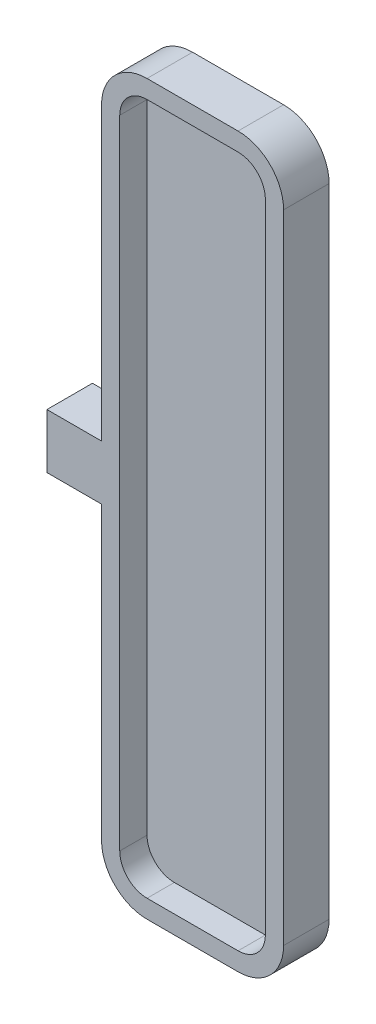
ISO-10303-21;
HEADER;
FILE_DESCRIPTION(('STEP AP214'),'2;1');
FILE_NAME('part.step','',(''),(''),'','','');
FILE_SCHEMA(('AUTOMOTIVE_DESIGN { 1 0 10303 214 1 1 1 1 }'));
ENDSEC;
DATA;
#1=APPLICATION_CONTEXT('core data for automotive mechanical design processes');
#2=APPLICATION_PROTOCOL_DEFINITION('international standard','automotive_design',2000,#1);
#3=PRODUCT_CONTEXT('',#1,'mechanical');
#4=PRODUCT('Part','Part','',(#3));
#5=PRODUCT_RELATED_PRODUCT_CATEGORY('part','',(#4));
#6=PRODUCT_DEFINITION_FORMATION('','',#4);
#7=PRODUCT_DEFINITION_CONTEXT('part definition',#1,'design');
#8=PRODUCT_DEFINITION('design','',#6,#7);
#9=PRODUCT_DEFINITION_SHAPE('','',#8);
#10=(LENGTH_UNIT() NAMED_UNIT(*) SI_UNIT(.MILLI.,.METRE.));
#11=(NAMED_UNIT(*) PLANE_ANGLE_UNIT() SI_UNIT($,.RADIAN.));
#12=(NAMED_UNIT(*) SI_UNIT($,.STERADIAN.) SOLID_ANGLE_UNIT());
#13=UNCERTAINTY_MEASURE_WITH_UNIT(LENGTH_MEASURE(1.E-05),#10,'distance_accuracy_value','');
#14=(GEOMETRIC_REPRESENTATION_CONTEXT(3) GLOBAL_UNCERTAINTY_ASSIGNED_CONTEXT((#13)) GLOBAL_UNIT_ASSIGNED_CONTEXT((#10,
#11,#12)) REPRESENTATION_CONTEXT('',''));
#15=CARTESIAN_POINT('',(0.,0.,0.));
#16=DIRECTION('',(0.,0.,1.));
#17=DIRECTION('',(1.,0.,0.));
#18=AXIS2_PLACEMENT_3D('',#15,#16,#17);
#19=CARTESIAN_POINT('',(-10.,-40.,5.));
#20=DIRECTION('',(1.,0.,0.));
#21=DIRECTION('',(0.,0.,-1.));
#22=AXIS2_PLACEMENT_3D('',#19,#20,#21);
#23=PLANE('',#22);
#24=DIRECTION('',(0.,0.,-1.));
#25=VECTOR('',#24,1.);
#26=CARTESIAN_POINT('',(-10.,3.,5.));
#27=LINE('',#26,#25);
#28=CARTESIAN_POINT('',(-10.,3.,5.));
#29=VERTEX_POINT('',#28);
#30=CARTESIAN_POINT('',(-10.,3.,0.));
#31=VERTEX_POINT('',#30);
#32=EDGE_CURVE('E63',#29,#31,#27,.T.);
#33=ORIENTED_EDGE('',*,*,#32,.F.);
#34=DIRECTION('',(0.,-1.,0.));
#35=VECTOR('',#34,1.);
#36=CARTESIAN_POINT('',(-10.,-40.,5.));
#37=LINE('',#36,#35);
#38=CARTESIAN_POINT('',(-10.,35.,5.));
#39=VERTEX_POINT('',#38);
#40=EDGE_CURVE('E184',#39,#29,#37,.T.);
#41=ORIENTED_EDGE('',*,*,#40,.F.);
#42=DIRECTION('',(0.,0.,-1.));
#43=VECTOR('',#42,1.);
#44=CARTESIAN_POINT('',(-10.,35.,5.));
#45=LINE('',#44,#43);
#46=CARTESIAN_POINT('',(-10.,35.,0.));
#47=VERTEX_POINT('',#46);
#48=EDGE_CURVE('E377',#39,#47,#45,.T.);
#49=ORIENTED_EDGE('',*,*,#48,.T.);
#50=DIRECTION('',(0.,-1.,0.));
#51=VECTOR('',#50,1.);
#52=CARTESIAN_POINT('',(-10.,-40.,0.));
#53=LINE('',#52,#51);
#54=EDGE_CURVE('E333',#47,#31,#53,.T.);
#55=ORIENTED_EDGE('',*,*,#54,.T.);
#56=EDGE_LOOP('',(#33,#41,#49,#55));
#57=FACE_BOUND('',#56,.T.);
#58=ADVANCED_FACE('F39',(#57),#23,.F.);
#59=DIRECTION('',(0.,0.,-1.));
#60=VECTOR('',#59,1.);
#61=CARTESIAN_POINT('',(-10.,-3.,5.));
#62=LINE('',#61,#60);
#63=CARTESIAN_POINT('',(-10.,-3.,5.));
#64=VERTEX_POINT('',#63);
#65=CARTESIAN_POINT('',(-10.,-3.,0.));
#66=VERTEX_POINT('',#65);
#67=EDGE_CURVE('E206',#64,#66,#62,.T.);
#68=ORIENTED_EDGE('',*,*,#67,.T.);
#69=CARTESIAN_POINT('',(-10.,-35.,0.));
#70=VERTEX_POINT('',#69);
#71=EDGE_CURVE('E332',#66,#70,#53,.T.);
#72=ORIENTED_EDGE('',*,*,#71,.T.);
#73=DIRECTION('',(0.,0.,-1.));
#74=VECTOR('',#73,1.);
#75=CARTESIAN_POINT('',(-10.,-35.,5.));
#76=LINE('',#75,#74);
#77=CARTESIAN_POINT('',(-10.,-35.,5.));
#78=VERTEX_POINT('',#77);
#79=EDGE_CURVE('E381',#70,#78,#76,.F.);
#80=ORIENTED_EDGE('',*,*,#79,.T.);
#81=EDGE_CURVE('E55',#64,#78,#37,.T.);
#82=ORIENTED_EDGE('',*,*,#81,.F.);
#83=EDGE_LOOP('',(#68,#72,#80,#82));
#84=FACE_BOUND('',#83,.T.);
#85=ADVANCED_FACE('F409',(#84),#23,.F.);
#86=CARTESIAN_POINT('',(10.,-40.,5.));
#87=DIRECTION('',(-1.,0.,0.));
#88=DIRECTION('',(0.,0.,1.));
#89=AXIS2_PLACEMENT_3D('',#86,#87,#88);
#90=PLANE('',#89);
#91=DIRECTION('',(0.,1.,0.));
#92=VECTOR('',#91,1.);
#93=CARTESIAN_POINT('',(10.,-40.,5.));
#94=LINE('',#93,#92);
#95=CARTESIAN_POINT('',(10.,-35.,5.));
#96=VERTEX_POINT('',#95);
#97=CARTESIAN_POINT('',(10.,35.,5.));
#98=VERTEX_POINT('',#97);
#99=EDGE_CURVE('E310',#96,#98,#94,.T.);
#100=ORIENTED_EDGE('',*,*,#99,.F.);
#101=DIRECTION('',(0.,0.,-1.));
#102=VECTOR('',#101,1.);
#103=CARTESIAN_POINT('',(10.,-35.,5.));
#104=LINE('',#103,#102);
#105=CARTESIAN_POINT('',(10.,-35.,0.));
#106=VERTEX_POINT('',#105);
#107=EDGE_CURVE('E341',#96,#106,#104,.T.);
#108=ORIENTED_EDGE('',*,*,#107,.T.);
#109=DIRECTION('',(0.,1.,0.));
#110=VECTOR('',#109,1.);
#111=CARTESIAN_POINT('',(10.,-40.,0.));
#112=LINE('',#111,#110);
#113=CARTESIAN_POINT('',(10.,35.,0.));
#114=VERTEX_POINT('',#113);
#115=EDGE_CURVE('E266',#106,#114,#112,.T.);
#116=ORIENTED_EDGE('',*,*,#115,.T.);
#117=DIRECTION('',(0.,0.,-1.));
#118=VECTOR('',#117,1.);
#119=CARTESIAN_POINT('',(10.,35.,5.));
#120=LINE('',#119,#118);
#121=EDGE_CURVE('E324',#114,#98,#120,.F.);
#122=ORIENTED_EDGE('',*,*,#121,.T.);
#123=EDGE_LOOP('',(#100,#108,#116,#122));
#124=FACE_BOUND('',#123,.T.);
#125=ADVANCED_FACE('F423',(#124),#90,.F.);
#126=CARTESIAN_POINT('',(-10.,40.,5.));
#127=DIRECTION('',(0.,-1.,0.));
#128=DIRECTION('',(0.,0.,-1.));
#129=AXIS2_PLACEMENT_3D('',#126,#127,#128);
#130=PLANE('',#129);
#131=DIRECTION('',(-1.,0.,0.));
#132=VECTOR('',#131,1.);
#133=CARTESIAN_POINT('',(-10.,40.,0.));
#134=LINE('',#133,#132);
#135=CARTESIAN_POINT('',(5.,40.,0.));
#136=VERTEX_POINT('',#135);
#137=CARTESIAN_POINT('',(-5.,40.,0.));
#138=VERTEX_POINT('',#137);
#139=EDGE_CURVE('E328',#136,#138,#134,.T.);
#140=ORIENTED_EDGE('',*,*,#139,.T.);
#141=DIRECTION('',(0.,0.,-1.));
#142=VECTOR('',#141,1.);
#143=CARTESIAN_POINT('',(-5.,40.,5.));
#144=LINE('',#143,#142);
#145=CARTESIAN_POINT('',(-5.,40.,5.));
#146=VERTEX_POINT('',#145);
#147=EDGE_CURVE('E11',#138,#146,#144,.F.);
#148=ORIENTED_EDGE('',*,*,#147,.T.);
#149=DIRECTION('',(-1.,0.,0.));
#150=VECTOR('',#149,1.);
#151=CARTESIAN_POINT('',(-10.,40.,5.));
#152=LINE('',#151,#150);
#153=CARTESIAN_POINT('',(5.,40.,5.));
#154=VERTEX_POINT('',#153);
#155=EDGE_CURVE('E314',#154,#146,#152,.T.);
#156=ORIENTED_EDGE('',*,*,#155,.F.);
#157=DIRECTION('',(0.,0.,-1.));
#158=VECTOR('',#157,1.);
#159=CARTESIAN_POINT('',(5.,40.,5.));
#160=LINE('',#159,#158);
#161=EDGE_CURVE('E48',#154,#136,#160,.T.);
#162=ORIENTED_EDGE('',*,*,#161,.T.);
#163=EDGE_LOOP('',(#140,#148,#156,#162));
#164=FACE_BOUND('',#163,.T.);
#165=ADVANCED_FACE('F389',(#164),#130,.F.);
#166=CARTESIAN_POINT('',(-10.,-40.,5.));
#167=DIRECTION('',(0.,1.,0.));
#168=DIRECTION('',(0.,0.,1.));
#169=AXIS2_PLACEMENT_3D('',#166,#167,#168);
#170=PLANE('',#169);
#171=DIRECTION('',(1.,0.,0.));
#172=VECTOR('',#171,1.);
#173=CARTESIAN_POINT('',(-10.,-40.,0.));
#174=LINE('',#173,#172);
#175=CARTESIAN_POINT('',(-5.,-40.,0.));
#176=VERTEX_POINT('',#175);
#177=CARTESIAN_POINT('',(5.,-40.,0.));
#178=VERTEX_POINT('',#177);
#179=EDGE_CURVE('E315',#176,#178,#174,.T.);
#180=ORIENTED_EDGE('',*,*,#179,.T.);
#181=DIRECTION('',(0.,0.,-1.));
#182=VECTOR('',#181,1.);
#183=CARTESIAN_POINT('',(5.,-40.,5.));
#184=LINE('',#183,#182);
#185=CARTESIAN_POINT('',(5.,-40.,5.));
#186=VERTEX_POINT('',#185);
#187=EDGE_CURVE('E362',#178,#186,#184,.F.);
#188=ORIENTED_EDGE('',*,*,#187,.T.);
#189=DIRECTION('',(1.,0.,0.));
#190=VECTOR('',#189,1.);
#191=CARTESIAN_POINT('',(-10.,-40.,5.));
#192=LINE('',#191,#190);
#193=CARTESIAN_POINT('',(-5.,-40.,5.));
#194=VERTEX_POINT('',#193);
#195=EDGE_CURVE('E321',#194,#186,#192,.T.);
#196=ORIENTED_EDGE('',*,*,#195,.F.);
#197=DIRECTION('',(0.,0.,-1.));
#198=VECTOR('',#197,1.);
#199=CARTESIAN_POINT('',(-5.,-40.,5.));
#200=LINE('',#199,#198);
#201=EDGE_CURVE('E358',#194,#176,#200,.T.);
#202=ORIENTED_EDGE('',*,*,#201,.T.);
#203=EDGE_LOOP('',(#180,#188,#196,#202));
#204=FACE_BOUND('',#203,.T.);
#205=ADVANCED_FACE('F415',(#204),#170,.F.);
#206=CARTESIAN_POINT('',(0.,0.,5.));
#207=DIRECTION('',(0.,0.,-1.));
#208=DIRECTION('',(-1.,0.,0.));
#209=AXIS2_PLACEMENT_3D('',#206,#207,#208);
#210=PLANE('',#209);
#211=DIRECTION('',(1.,0.,0.));
#212=VECTOR('',#211,1.);
#213=CARTESIAN_POINT('',(0.,-38.,5.));
#214=LINE('',#213,#212);
#215=CARTESIAN_POINT('',(-5.,-38.,5.));
#216=VERTEX_POINT('',#215);
#217=CARTESIAN_POINT('',(5.,-38.,5.));
#218=VERTEX_POINT('',#217);
#219=EDGE_CURVE('E238',#216,#218,#214,.T.);
#220=ORIENTED_EDGE('',*,*,#219,.F.);
#221=CARTESIAN_POINT('',(-5.,-35.,5.));
#222=DIRECTION('',(0.,0.,-1.));
#223=DIRECTION('',(-1.,0.,0.));
#224=AXIS2_PLACEMENT_3D('',#221,#222,#223);
#225=CIRCLE('',#224,3.);
#226=CARTESIAN_POINT('',(-8.,-35.,5.));
#227=VERTEX_POINT('',#226);
#228=EDGE_CURVE('E300',#227,#216,#225,.F.);
#229=ORIENTED_EDGE('',*,*,#228,.F.);
#230=DIRECTION('',(0.,-1.,0.));
#231=VECTOR('',#230,1.);
#232=CARTESIAN_POINT('',(-8.,0.,5.));
#233=LINE('',#232,#231);
#234=CARTESIAN_POINT('',(-8.,35.,5.));
#235=VERTEX_POINT('',#234);
#236=EDGE_CURVE('E297',#235,#227,#233,.T.);
#237=ORIENTED_EDGE('',*,*,#236,.F.);
#238=CARTESIAN_POINT('',(-5.,35.,5.));
#239=DIRECTION('',(0.,0.,-1.));
#240=DIRECTION('',(-1.,0.,0.));
#241=AXIS2_PLACEMENT_3D('',#238,#239,#240);
#242=CIRCLE('',#241,3.);
#243=CARTESIAN_POINT('',(-5.,38.,5.));
#244=VERTEX_POINT('',#243);
#245=EDGE_CURVE('E293',#244,#235,#242,.F.);
#246=ORIENTED_EDGE('',*,*,#245,.F.);
#247=DIRECTION('',(-1.,0.,0.));
#248=VECTOR('',#247,1.);
#249=CARTESIAN_POINT('',(0.,38.,5.));
#250=LINE('',#249,#248);
#251=CARTESIAN_POINT('',(5.,38.,5.));
#252=VERTEX_POINT('',#251);
#253=EDGE_CURVE('E290',#252,#244,#250,.T.);
#254=ORIENTED_EDGE('',*,*,#253,.F.);
#255=CARTESIAN_POINT('',(5.,35.,5.));
#256=DIRECTION('',(0.,0.,-1.));
#257=DIRECTION('',(-1.,0.,0.));
#258=AXIS2_PLACEMENT_3D('',#255,#256,#257);
#259=CIRCLE('',#258,3.);
#260=CARTESIAN_POINT('',(8.,35.,5.));
#261=VERTEX_POINT('',#260);
#262=EDGE_CURVE('E286',#261,#252,#259,.F.);
#263=ORIENTED_EDGE('',*,*,#262,.F.);
#264=DIRECTION('',(0.,1.,0.));
#265=VECTOR('',#264,1.);
#266=CARTESIAN_POINT('',(8.,0.,5.));
#267=LINE('',#266,#265);
#268=CARTESIAN_POINT('',(8.,-35.,5.));
#269=VERTEX_POINT('',#268);
#270=EDGE_CURVE('E248',#269,#261,#267,.T.);
#271=ORIENTED_EDGE('',*,*,#270,.F.);
#272=CARTESIAN_POINT('',(5.,-35.,5.));
#273=DIRECTION('',(0.,0.,-1.));
#274=DIRECTION('',(-1.,0.,0.));
#275=AXIS2_PLACEMENT_3D('',#272,#273,#274);
#276=CIRCLE('',#275,3.);
#277=EDGE_CURVE('E276',#218,#269,#276,.F.);
#278=ORIENTED_EDGE('',*,*,#277,.F.);
#279=EDGE_LOOP('',(#220,#229,#237,#246,#254,#263,#271,#278));
#280=FACE_BOUND('',#279,.T.);
#281=ORIENTED_EDGE('',*,*,#195,.T.);
#282=CARTESIAN_POINT('',(5.,-35.,5.));
#283=DIRECTION('',(0.,0.,-1.));
#284=DIRECTION('',(-1.,0.,0.));
#285=AXIS2_PLACEMENT_3D('',#282,#283,#284);
#286=CIRCLE('',#285,5.);
#287=EDGE_CURVE('E374',#186,#96,#286,.F.);
#288=ORIENTED_EDGE('',*,*,#287,.T.);
#289=ORIENTED_EDGE('',*,*,#99,.T.);
#290=CARTESIAN_POINT('',(5.,35.,5.));
#291=DIRECTION('',(0.,0.,-1.));
#292=DIRECTION('',(-1.,0.,0.));
#293=AXIS2_PLACEMENT_3D('',#290,#291,#292);
#294=CIRCLE('',#293,5.);
#295=EDGE_CURVE('E365',#98,#154,#294,.F.);
#296=ORIENTED_EDGE('',*,*,#295,.T.);
#297=ORIENTED_EDGE('',*,*,#155,.T.);
#298=CARTESIAN_POINT('',(-5.,35.,5.));
#299=DIRECTION('',(0.,0.,-1.));
#300=DIRECTION('',(-1.,0.,0.));
#301=AXIS2_PLACEMENT_3D('',#298,#299,#300);
#302=CIRCLE('',#301,5.);
#303=EDGE_CURVE('E368',#146,#39,#302,.F.);
#304=ORIENTED_EDGE('',*,*,#303,.T.);
#305=ORIENTED_EDGE('',*,*,#40,.T.);
#306=DIRECTION('',(-1.,0.,0.));
#307=VECTOR('',#306,1.);
#308=CARTESIAN_POINT('',(-10.,3.,5.));
#309=LINE('',#308,#307);
#310=CARTESIAN_POINT('',(-16.,3.,5.));
#311=VERTEX_POINT('',#310);
#312=EDGE_CURVE('E177',#29,#311,#309,.T.);
#313=ORIENTED_EDGE('',*,*,#312,.T.);
#314=DIRECTION('',(0.,-1.,0.));
#315=VECTOR('',#314,1.);
#316=CARTESIAN_POINT('',(-16.,3.,5.));
#317=LINE('',#316,#315);
#318=CARTESIAN_POINT('',(-16.,-3.,5.));
#319=VERTEX_POINT('',#318);
#320=EDGE_CURVE('E182',#311,#319,#317,.T.);
#321=ORIENTED_EDGE('',*,*,#320,.T.);
#322=DIRECTION('',(1.,0.,0.));
#323=VECTOR('',#322,1.);
#324=CARTESIAN_POINT('',(-10.,-3.,5.));
#325=LINE('',#324,#323);
#326=EDGE_CURVE('E203',#319,#64,#325,.T.);
#327=ORIENTED_EDGE('',*,*,#326,.T.);
#328=ORIENTED_EDGE('',*,*,#81,.T.);
#329=CARTESIAN_POINT('',(-5.,-35.,5.));
#330=DIRECTION('',(0.,0.,-1.));
#331=DIRECTION('',(-1.,0.,0.));
#332=AXIS2_PLACEMENT_3D('',#329,#330,#331);
#333=CIRCLE('',#332,5.);
#334=EDGE_CURVE('E371',#78,#194,#333,.F.);
#335=ORIENTED_EDGE('',*,*,#334,.T.);
#336=EDGE_LOOP('',(#281,#288,#289,#296,#297,#304,#305,#313,#321,#327,#328,#335));
#337=FACE_BOUND('',#336,.T.);
#338=ADVANCED_FACE('F180',(#280,#337),#210,.F.);
#339=CARTESIAN_POINT('',(0.,0.,0.));
#340=DIRECTION('',(0.,0.,-1.));
#341=DIRECTION('',(-1.,0.,0.));
#342=AXIS2_PLACEMENT_3D('',#339,#340,#341);
#343=PLANE('',#342);
#344=ORIENTED_EDGE('',*,*,#115,.F.);
#345=CARTESIAN_POINT('',(5.,-35.,0.));
#346=DIRECTION('',(0.,0.,-1.));
#347=DIRECTION('',(-1.,0.,0.));
#348=AXIS2_PLACEMENT_3D('',#345,#346,#347);
#349=CIRCLE('',#348,5.);
#350=EDGE_CURVE('E355',#106,#178,#349,.T.);
#351=ORIENTED_EDGE('',*,*,#350,.T.);
#352=ORIENTED_EDGE('',*,*,#179,.F.);
#353=CARTESIAN_POINT('',(-5.,-35.,0.));
#354=DIRECTION('',(0.,0.,-1.));
#355=DIRECTION('',(-1.,0.,0.));
#356=AXIS2_PLACEMENT_3D('',#353,#354,#355);
#357=CIRCLE('',#356,5.);
#358=EDGE_CURVE('E351',#176,#70,#357,.T.);
#359=ORIENTED_EDGE('',*,*,#358,.T.);
#360=ORIENTED_EDGE('',*,*,#71,.F.);
#361=DIRECTION('',(1.,0.,0.));
#362=VECTOR('',#361,1.);
#363=CARTESIAN_POINT('',(-10.,-3.,0.));
#364=LINE('',#363,#362);
#365=CARTESIAN_POINT('',(-16.,-3.,0.));
#366=VERTEX_POINT('',#365);
#367=EDGE_CURVE('E187',#366,#66,#364,.T.);
#368=ORIENTED_EDGE('',*,*,#367,.F.);
#369=DIRECTION('',(0.,-1.,0.));
#370=VECTOR('',#369,1.);
#371=CARTESIAN_POINT('',(-16.,3.,0.));
#372=LINE('',#371,#370);
#373=CARTESIAN_POINT('',(-16.,3.,0.));
#374=VERTEX_POINT('',#373);
#375=EDGE_CURVE('E212',#374,#366,#372,.T.);
#376=ORIENTED_EDGE('',*,*,#375,.F.);
#377=DIRECTION('',(-1.,0.,0.));
#378=VECTOR('',#377,1.);
#379=CARTESIAN_POINT('',(-10.,3.,0.));
#380=LINE('',#379,#378);
#381=EDGE_CURVE('E193',#31,#374,#380,.T.);
#382=ORIENTED_EDGE('',*,*,#381,.F.);
#383=ORIENTED_EDGE('',*,*,#54,.F.);
#384=CARTESIAN_POINT('',(-5.,35.,0.));
#385=DIRECTION('',(0.,0.,-1.));
#386=DIRECTION('',(-1.,0.,0.));
#387=AXIS2_PLACEMENT_3D('',#384,#385,#386);
#388=CIRCLE('',#387,5.);
#389=EDGE_CURVE('E348',#47,#138,#388,.T.);
#390=ORIENTED_EDGE('',*,*,#389,.T.);
#391=ORIENTED_EDGE('',*,*,#139,.F.);
#392=CARTESIAN_POINT('',(5.,35.,0.));
#393=DIRECTION('',(0.,0.,-1.));
#394=DIRECTION('',(-1.,0.,0.));
#395=AXIS2_PLACEMENT_3D('',#392,#393,#394);
#396=CIRCLE('',#395,5.);
#397=EDGE_CURVE('E345',#136,#114,#396,.T.);
#398=ORIENTED_EDGE('',*,*,#397,.T.);
#399=EDGE_LOOP('',(#344,#351,#352,#359,#360,#368,#376,#382,#383,#390,#391,#398));
#400=FACE_BOUND('',#399,.T.);
#401=ADVANCED_FACE('F395',(#400),#343,.T.);
#402=CARTESIAN_POINT('',(5.,-35.,5.));
#403=DIRECTION('',(0.,0.,-1.));
#404=DIRECTION('',(-1.,0.,0.));
#405=AXIS2_PLACEMENT_3D('',#402,#403,#404);
#406=CYLINDRICAL_SURFACE('',#405,5.);
#407=ORIENTED_EDGE('',*,*,#287,.F.);
#408=ORIENTED_EDGE('',*,*,#187,.F.);
#409=ORIENTED_EDGE('',*,*,#350,.F.);
#410=ORIENTED_EDGE('',*,*,#107,.F.);
#411=EDGE_LOOP('',(#407,#408,#409,#410));
#412=FACE_BOUND('',#411,.T.);
#413=ADVANCED_FACE('F420',(#412),#406,.T.);
#414=CARTESIAN_POINT('',(-5.,-35.,5.));
#415=DIRECTION('',(0.,0.,-1.));
#416=DIRECTION('',(-1.,0.,0.));
#417=AXIS2_PLACEMENT_3D('',#414,#415,#416);
#418=CYLINDRICAL_SURFACE('',#417,5.);
#419=ORIENTED_EDGE('',*,*,#334,.F.);
#420=ORIENTED_EDGE('',*,*,#79,.F.);
#421=ORIENTED_EDGE('',*,*,#358,.F.);
#422=ORIENTED_EDGE('',*,*,#201,.F.);
#423=EDGE_LOOP('',(#419,#420,#421,#422));
#424=FACE_BOUND('',#423,.T.);
#425=ADVANCED_FACE('F412',(#424),#418,.T.);
#426=CARTESIAN_POINT('',(-5.,35.,5.));
#427=DIRECTION('',(0.,0.,-1.));
#428=DIRECTION('',(-1.,0.,0.));
#429=AXIS2_PLACEMENT_3D('',#426,#427,#428);
#430=CYLINDRICAL_SURFACE('',#429,5.);
#431=ORIENTED_EDGE('',*,*,#303,.F.);
#432=ORIENTED_EDGE('',*,*,#147,.F.);
#433=ORIENTED_EDGE('',*,*,#389,.F.);
#434=ORIENTED_EDGE('',*,*,#48,.F.);
#435=EDGE_LOOP('',(#431,#432,#433,#434));
#436=FACE_BOUND('',#435,.T.);
#437=ADVANCED_FACE('F400',(#436),#430,.T.);
#438=CARTESIAN_POINT('',(5.,35.,5.));
#439=DIRECTION('',(0.,0.,-1.));
#440=DIRECTION('',(-1.,0.,0.));
#441=AXIS2_PLACEMENT_3D('',#438,#439,#440);
#442=CYLINDRICAL_SURFACE('',#441,5.);
#443=ORIENTED_EDGE('',*,*,#295,.F.);
#444=ORIENTED_EDGE('',*,*,#121,.F.);
#445=ORIENTED_EDGE('',*,*,#397,.F.);
#446=ORIENTED_EDGE('',*,*,#161,.F.);
#447=EDGE_LOOP('',(#443,#444,#445,#446));
#448=FACE_BOUND('',#447,.T.);
#449=ADVANCED_FACE('F41',(#448),#442,.T.);
#450=CARTESIAN_POINT('',(8.,-40.,5.));
#451=DIRECTION('',(-1.,0.,0.));
#452=DIRECTION('',(0.,0.,1.));
#453=AXIS2_PLACEMENT_3D('',#450,#451,#452);
#454=PLANE('',#453);
#455=ORIENTED_EDGE('',*,*,#270,.T.);
#456=DIRECTION('',(0.,0.,1.));
#457=VECTOR('',#456,1.);
#458=CARTESIAN_POINT('',(8.,35.,5.));
#459=LINE('',#458,#457);
#460=CARTESIAN_POINT('',(8.,35.,2.));
#461=VERTEX_POINT('',#460);
#462=EDGE_CURVE('E231',#461,#261,#459,.T.);
#463=ORIENTED_EDGE('',*,*,#462,.F.);
#464=DIRECTION('',(0.,1.,0.));
#465=VECTOR('',#464,1.);
#466=CARTESIAN_POINT('',(8.,0.,2.));
#467=LINE('',#466,#465);
#468=CARTESIAN_POINT('',(8.,-35.,2.));
#469=VERTEX_POINT('',#468);
#470=EDGE_CURVE('E225',#469,#461,#467,.T.);
#471=ORIENTED_EDGE('',*,*,#470,.F.);
#472=DIRECTION('',(0.,0.,1.));
#473=VECTOR('',#472,1.);
#474=CARTESIAN_POINT('',(8.,-35.,5.));
#475=LINE('',#474,#473);
#476=EDGE_CURVE('E226',#269,#469,#475,.F.);
#477=ORIENTED_EDGE('',*,*,#476,.F.);
#478=EDGE_LOOP('',(#455,#463,#471,#477));
#479=FACE_BOUND('',#478,.T.);
#480=ADVANCED_FACE('F426',(#479),#454,.T.);
#481=CARTESIAN_POINT('',(-10.,38.,5.));
#482=DIRECTION('',(0.,-1.,0.));
#483=DIRECTION('',(0.,0.,-1.));
#484=AXIS2_PLACEMENT_3D('',#481,#482,#483);
#485=PLANE('',#484);
#486=DIRECTION('',(-1.,0.,0.));
#487=VECTOR('',#486,1.);
#488=CARTESIAN_POINT('',(0.,38.,2.));
#489=LINE('',#488,#487);
#490=CARTESIAN_POINT('',(5.,38.,2.));
#491=VERTEX_POINT('',#490);
#492=CARTESIAN_POINT('',(-5.,38.,2.));
#493=VERTEX_POINT('',#492);
#494=EDGE_CURVE('E235',#491,#493,#489,.T.);
#495=ORIENTED_EDGE('',*,*,#494,.F.);
#496=DIRECTION('',(0.,0.,-1.));
#497=VECTOR('',#496,1.);
#498=CARTESIAN_POINT('',(5.,38.,5.));
#499=LINE('',#498,#497);
#500=EDGE_CURVE('E267',#252,#491,#499,.T.);
#501=ORIENTED_EDGE('',*,*,#500,.F.);
#502=ORIENTED_EDGE('',*,*,#253,.T.);
#503=DIRECTION('',(0.,0.,-1.));
#504=VECTOR('',#503,1.);
#505=CARTESIAN_POINT('',(-5.,38.,5.));
#506=LINE('',#505,#504);
#507=EDGE_CURVE('E263',#493,#244,#506,.F.);
#508=ORIENTED_EDGE('',*,*,#507,.F.);
#509=EDGE_LOOP('',(#495,#501,#502,#508));
#510=FACE_BOUND('',#509,.T.);
#511=ADVANCED_FACE('F431',(#510),#485,.T.);
#512=CARTESIAN_POINT('',(-8.,-40.,5.));
#513=DIRECTION('',(1.,0.,0.));
#514=DIRECTION('',(0.,0.,-1.));
#515=AXIS2_PLACEMENT_3D('',#512,#513,#514);
#516=PLANE('',#515);
#517=DIRECTION('',(0.,-1.,0.));
#518=VECTOR('',#517,1.);
#519=CARTESIAN_POINT('',(-8.,0.,2.));
#520=LINE('',#519,#518);
#521=CARTESIAN_POINT('',(-8.,35.,2.));
#522=VERTEX_POINT('',#521);
#523=CARTESIAN_POINT('',(-8.,-35.,2.));
#524=VERTEX_POINT('',#523);
#525=EDGE_CURVE('E249',#522,#524,#520,.T.);
#526=ORIENTED_EDGE('',*,*,#525,.F.);
#527=DIRECTION('',(0.,0.,-1.));
#528=VECTOR('',#527,1.);
#529=CARTESIAN_POINT('',(-8.,35.,5.));
#530=LINE('',#529,#528);
#531=EDGE_CURVE('E272',#235,#522,#530,.T.);
#532=ORIENTED_EDGE('',*,*,#531,.F.);
#533=ORIENTED_EDGE('',*,*,#236,.T.);
#534=DIRECTION('',(0.,0.,-1.));
#535=VECTOR('',#534,1.);
#536=CARTESIAN_POINT('',(-8.,-35.,5.));
#537=LINE('',#536,#535);
#538=EDGE_CURVE('E271',#524,#227,#537,.F.);
#539=ORIENTED_EDGE('',*,*,#538,.F.);
#540=EDGE_LOOP('',(#526,#532,#533,#539));
#541=FACE_BOUND('',#540,.T.);
#542=ADVANCED_FACE('F477',(#541),#516,.T.);
#543=CARTESIAN_POINT('',(-10.,-38.,5.));
#544=DIRECTION('',(0.,1.,0.));
#545=DIRECTION('',(0.,0.,1.));
#546=AXIS2_PLACEMENT_3D('',#543,#544,#545);
#547=PLANE('',#546);
#548=DIRECTION('',(1.,0.,0.));
#549=VECTOR('',#548,1.);
#550=CARTESIAN_POINT('',(0.,-38.,2.));
#551=LINE('',#550,#549);
#552=CARTESIAN_POINT('',(-5.,-38.,2.));
#553=VERTEX_POINT('',#552);
#554=CARTESIAN_POINT('',(5.,-38.,2.));
#555=VERTEX_POINT('',#554);
#556=EDGE_CURVE('E244',#553,#555,#551,.T.);
#557=ORIENTED_EDGE('',*,*,#556,.F.);
#558=DIRECTION('',(0.,0.,1.));
#559=VECTOR('',#558,1.);
#560=CARTESIAN_POINT('',(-5.,-38.,5.));
#561=LINE('',#560,#559);
#562=EDGE_CURVE('E242',#216,#553,#561,.F.);
#563=ORIENTED_EDGE('',*,*,#562,.F.);
#564=ORIENTED_EDGE('',*,*,#219,.T.);
#565=DIRECTION('',(0.,0.,1.));
#566=VECTOR('',#565,1.);
#567=CARTESIAN_POINT('',(5.,-38.,5.));
#568=LINE('',#567,#566);
#569=EDGE_CURVE('E283',#555,#218,#568,.T.);
#570=ORIENTED_EDGE('',*,*,#569,.F.);
#571=EDGE_LOOP('',(#557,#563,#564,#570));
#572=FACE_BOUND('',#571,.T.);
#573=ADVANCED_FACE('F487',(#572),#547,.T.);
#574=CARTESIAN_POINT('',(0.,0.,2.));
#575=DIRECTION('',(0.,0.,-1.));
#576=DIRECTION('',(-1.,0.,0.));
#577=AXIS2_PLACEMENT_3D('',#574,#575,#576);
#578=PLANE('',#577);
#579=ORIENTED_EDGE('',*,*,#470,.T.);
#580=CARTESIAN_POINT('',(5.,35.,2.));
#581=DIRECTION('',(0.,0.,-1.));
#582=DIRECTION('',(-1.,0.,0.));
#583=AXIS2_PLACEMENT_3D('',#580,#581,#582);
#584=CIRCLE('',#583,3.);
#585=EDGE_CURVE('E230',#491,#461,#584,.T.);
#586=ORIENTED_EDGE('',*,*,#585,.F.);
#587=ORIENTED_EDGE('',*,*,#494,.T.);
#588=CARTESIAN_POINT('',(-5.,35.,2.));
#589=DIRECTION('',(0.,0.,-1.));
#590=DIRECTION('',(-1.,0.,0.));
#591=AXIS2_PLACEMENT_3D('',#588,#589,#590);
#592=CIRCLE('',#591,3.);
#593=EDGE_CURVE('E252',#522,#493,#592,.T.);
#594=ORIENTED_EDGE('',*,*,#593,.F.);
#595=ORIENTED_EDGE('',*,*,#525,.T.);
#596=CARTESIAN_POINT('',(-5.,-35.,2.));
#597=DIRECTION('',(0.,0.,-1.));
#598=DIRECTION('',(-1.,0.,0.));
#599=AXIS2_PLACEMENT_3D('',#596,#597,#598);
#600=CIRCLE('',#599,3.);
#601=EDGE_CURVE('E243',#553,#524,#600,.T.);
#602=ORIENTED_EDGE('',*,*,#601,.F.);
#603=ORIENTED_EDGE('',*,*,#556,.T.);
#604=CARTESIAN_POINT('',(5.,-35.,2.));
#605=DIRECTION('',(0.,0.,-1.));
#606=DIRECTION('',(-1.,0.,0.));
#607=AXIS2_PLACEMENT_3D('',#604,#605,#606);
#608=CIRCLE('',#607,3.);
#609=EDGE_CURVE('E239',#469,#555,#608,.T.);
#610=ORIENTED_EDGE('',*,*,#609,.F.);
#611=EDGE_LOOP('',(#579,#586,#587,#594,#595,#602,#603,#610));
#612=FACE_BOUND('',#611,.T.);
#613=ADVANCED_FACE('F497',(#612),#578,.F.);
#614=CARTESIAN_POINT('',(5.,-35.,5.));
#615=DIRECTION('',(0.,0.,-1.));
#616=DIRECTION('',(-1.,0.,0.));
#617=AXIS2_PLACEMENT_3D('',#614,#615,#616);
#618=CYLINDRICAL_SURFACE('',#617,3.);
#619=ORIENTED_EDGE('',*,*,#277,.T.);
#620=ORIENTED_EDGE('',*,*,#476,.T.);
#621=ORIENTED_EDGE('',*,*,#609,.T.);
#622=ORIENTED_EDGE('',*,*,#569,.T.);
#623=EDGE_LOOP('',(#619,#620,#621,#622));
#624=FACE_BOUND('',#623,.T.);
#625=ADVANCED_FACE('F507',(#624),#618,.F.);
#626=CARTESIAN_POINT('',(-5.,-35.,5.));
#627=DIRECTION('',(0.,0.,-1.));
#628=DIRECTION('',(-1.,0.,0.));
#629=AXIS2_PLACEMENT_3D('',#626,#627,#628);
#630=CYLINDRICAL_SURFACE('',#629,3.);
#631=ORIENTED_EDGE('',*,*,#228,.T.);
#632=ORIENTED_EDGE('',*,*,#562,.T.);
#633=ORIENTED_EDGE('',*,*,#601,.T.);
#634=ORIENTED_EDGE('',*,*,#538,.T.);
#635=EDGE_LOOP('',(#631,#632,#633,#634));
#636=FACE_BOUND('',#635,.T.);
#637=ADVANCED_FACE('F517',(#636),#630,.F.);
#638=CARTESIAN_POINT('',(-5.,35.,5.));
#639=DIRECTION('',(0.,0.,-1.));
#640=DIRECTION('',(-1.,0.,0.));
#641=AXIS2_PLACEMENT_3D('',#638,#639,#640);
#642=CYLINDRICAL_SURFACE('',#641,3.);
#643=ORIENTED_EDGE('',*,*,#245,.T.);
#644=ORIENTED_EDGE('',*,*,#531,.T.);
#645=ORIENTED_EDGE('',*,*,#593,.T.);
#646=ORIENTED_EDGE('',*,*,#507,.T.);
#647=EDGE_LOOP('',(#643,#644,#645,#646));
#648=FACE_BOUND('',#647,.T.);
#649=ADVANCED_FACE('F527',(#648),#642,.F.);
#650=CARTESIAN_POINT('',(5.,35.,5.));
#651=DIRECTION('',(0.,0.,-1.));
#652=DIRECTION('',(-1.,0.,0.));
#653=AXIS2_PLACEMENT_3D('',#650,#651,#652);
#654=CYLINDRICAL_SURFACE('',#653,3.);
#655=ORIENTED_EDGE('',*,*,#262,.T.);
#656=ORIENTED_EDGE('',*,*,#500,.T.);
#657=ORIENTED_EDGE('',*,*,#585,.T.);
#658=ORIENTED_EDGE('',*,*,#462,.T.);
#659=EDGE_LOOP('',(#655,#656,#657,#658));
#660=FACE_BOUND('',#659,.T.);
#661=ADVANCED_FACE('F537',(#660),#654,.F.);
#662=CARTESIAN_POINT('',(-10.,3.,5.));
#663=DIRECTION('',(0.,-1.,0.));
#664=DIRECTION('',(1.,0.,0.));
#665=AXIS2_PLACEMENT_3D('',#662,#663,#664);
#666=PLANE('',#665);
#667=ORIENTED_EDGE('',*,*,#381,.T.);
#668=DIRECTION('',(0.,0.,-1.));
#669=VECTOR('',#668,1.);
#670=CARTESIAN_POINT('',(-16.,3.,5.));
#671=LINE('',#670,#669);
#672=EDGE_CURVE('E190',#311,#374,#671,.T.);
#673=ORIENTED_EDGE('',*,*,#672,.F.);
#674=ORIENTED_EDGE('',*,*,#312,.F.);
#675=ORIENTED_EDGE('',*,*,#32,.T.);
#676=EDGE_LOOP('',(#667,#673,#674,#675));
#677=FACE_BOUND('',#676,.T.);
#678=ADVANCED_FACE('F191',(#677),#666,.F.);
#679=CARTESIAN_POINT('',(-16.,3.,5.));
#680=DIRECTION('',(1.,0.,0.));
#681=DIRECTION('',(0.,0.,-1.));
#682=AXIS2_PLACEMENT_3D('',#679,#680,#681);
#683=PLANE('',#682);
#684=CARTESIAN_POINT('',(-16.,0.,2.5));
#685=DIRECTION('',(-1.,0.,0.));
#686=DIRECTION('',(0.,0.,1.));
#687=AXIS2_PLACEMENT_3D('',#684,#685,#686);
#688=CIRCLE('',#687,1.425);
#689=CARTESIAN_POINT('',(-16.,0.,3.925));
#690=VERTEX_POINT('',#689);
#691=EDGE_CURVE('E627',#690,#690,#688,.T.);
#692=ORIENTED_EDGE('',*,*,#691,.F.);
#693=EDGE_LOOP('',(#692));
#694=FACE_BOUND('',#693,.T.);
#695=ORIENTED_EDGE('',*,*,#375,.T.);
#696=DIRECTION('',(0.,0.,-1.));
#697=VECTOR('',#696,1.);
#698=CARTESIAN_POINT('',(-16.,-3.,5.));
#699=LINE('',#698,#697);
#700=EDGE_CURVE('E197',#319,#366,#699,.T.);
#701=ORIENTED_EDGE('',*,*,#700,.F.);
#702=ORIENTED_EDGE('',*,*,#320,.F.);
#703=ORIENTED_EDGE('',*,*,#672,.T.);
#704=EDGE_LOOP('',(#695,#701,#702,#703));
#705=FACE_BOUND('',#704,.T.);
#706=ADVANCED_FACE('F199',(#694,#705),#683,.F.);
#707=CARTESIAN_POINT('',(-10.,-3.,5.));
#708=DIRECTION('',(0.,1.,0.));
#709=DIRECTION('',(-1.,0.,0.));
#710=AXIS2_PLACEMENT_3D('',#707,#708,#709);
#711=PLANE('',#710);
#712=ORIENTED_EDGE('',*,*,#367,.T.);
#713=ORIENTED_EDGE('',*,*,#67,.F.);
#714=ORIENTED_EDGE('',*,*,#326,.F.);
#715=ORIENTED_EDGE('',*,*,#700,.T.);
#716=EDGE_LOOP('',(#712,#713,#714,#715));
#717=FACE_BOUND('',#716,.T.);
#718=ADVANCED_FACE('F403',(#717),#711,.F.);
#719=CARTESIAN_POINT('',(-12.,0.,2.5));
#720=DIRECTION('',(-1.,0.,0.));
#721=DIRECTION('',(0.,0.,1.));
#722=AXIS2_PLACEMENT_3D('',#719,#720,#721);
#723=CYLINDRICAL_SURFACE('',#722,1.425);
#724=CARTESIAN_POINT('',(-12.,0.,2.5));
#725=DIRECTION('',(-1.,0.,0.));
#726=DIRECTION('',(0.,0.,1.));
#727=AXIS2_PLACEMENT_3D('',#724,#725,#726);
#728=CIRCLE('',#727,1.425);
#729=CARTESIAN_POINT('',(-12.,0.,3.925));
#730=VERTEX_POINT('',#729);
#731=EDGE_CURVE('E213',#730,#730,#728,.T.);
#732=ORIENTED_EDGE('',*,*,#731,.F.);
#733=EDGE_LOOP('',(#732));
#734=FACE_BOUND('',#733,.T.);
#735=ORIENTED_EDGE('',*,*,#691,.T.);
#736=EDGE_LOOP('',(#735));
#737=FACE_BOUND('',#736,.T.);
#738=ADVANCED_FACE('F594',(#734,#737),#723,.F.);
#739=CARTESIAN_POINT('',(-12.,0.,2.5));
#740=DIRECTION('',(-1.,0.,0.));
#741=DIRECTION('',(0.,0.,1.));
#742=AXIS2_PLACEMENT_3D('',#739,#740,#741);
#743=PLANE('',#742);
#744=ORIENTED_EDGE('',*,*,#731,.T.);
#745=EDGE_LOOP('',(#744));
#746=FACE_BOUND('',#745,.T.);
#747=ADVANCED_FACE('F610',(#746),#743,.T.);
#748=CLOSED_SHELL('',(#58,#85,#125,#165,#205,#338,#401,#413,#425,#437,#449,#480,#511,#542,#573,
#613,#625,#637,#649,#661,#678,#706,#718,#738,#747));
#749=MANIFOLD_SOLID_BREP('B2',#748);
#750=ADVANCED_BREP_SHAPE_REPRESENTATION('',(#18,#749),#14);
#751=SHAPE_DEFINITION_REPRESENTATION(#9,#750);
ENDSEC;
END-ISO-10303-21;
